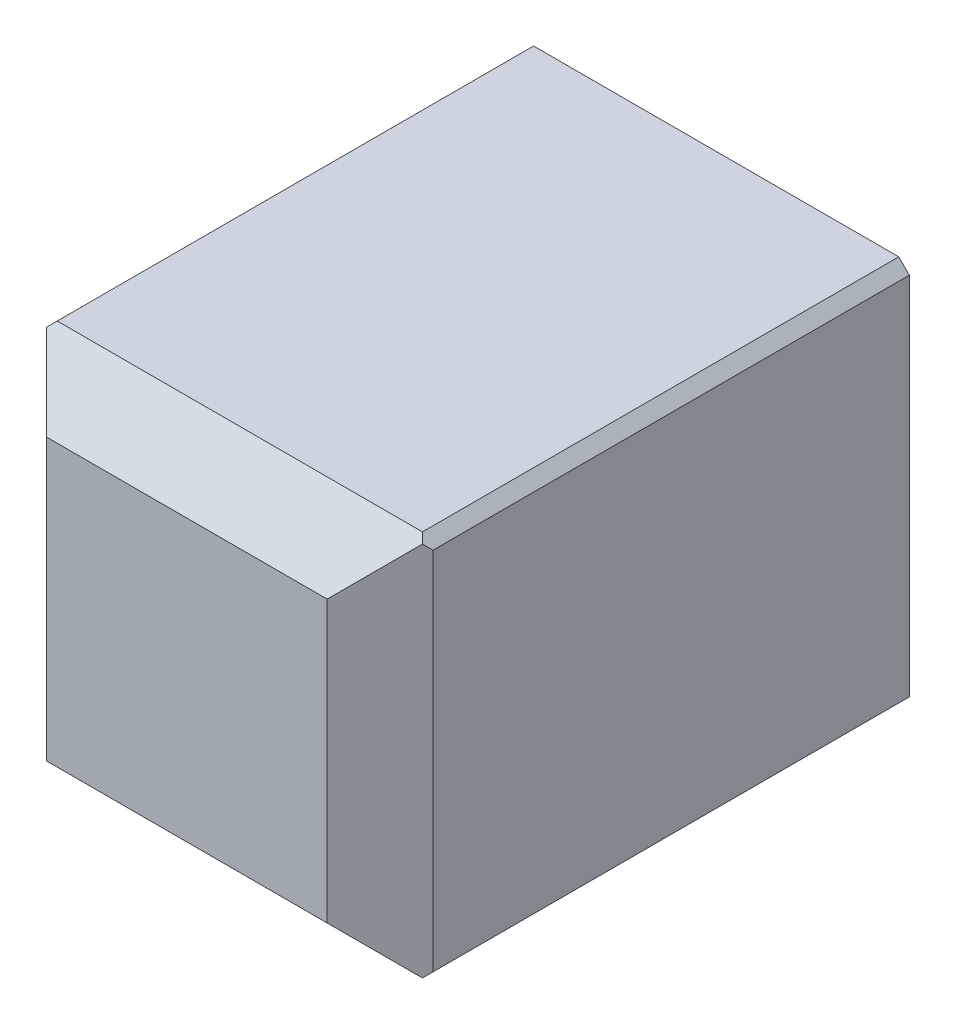
ISO-10303-21;
HEADER;
FILE_DESCRIPTION(('STEP AP214'),'2;1');
FILE_NAME('part.step','',(''),(''),'','','');
FILE_SCHEMA(('AUTOMOTIVE_DESIGN { 1 0 10303 214 1 1 1 1 }'));
ENDSEC;
DATA;
#1=APPLICATION_CONTEXT('core data for automotive mechanical design processes');
#2=APPLICATION_PROTOCOL_DEFINITION('international standard','automotive_design',2000,#1);
#3=PRODUCT_CONTEXT('',#1,'mechanical');
#4=PRODUCT('Part','Part','',(#3));
#5=PRODUCT_RELATED_PRODUCT_CATEGORY('part','',(#4));
#6=PRODUCT_DEFINITION_FORMATION('','',#4);
#7=PRODUCT_DEFINITION_CONTEXT('part definition',#1,'design');
#8=PRODUCT_DEFINITION('design','',#6,#7);
#9=PRODUCT_DEFINITION_SHAPE('','',#8);
#10=(LENGTH_UNIT() NAMED_UNIT(*) SI_UNIT(.MILLI.,.METRE.));
#11=(NAMED_UNIT(*) PLANE_ANGLE_UNIT() SI_UNIT($,.RADIAN.));
#12=(NAMED_UNIT(*) SI_UNIT($,.STERADIAN.) SOLID_ANGLE_UNIT());
#13=UNCERTAINTY_MEASURE_WITH_UNIT(LENGTH_MEASURE(1.E-05),#10,'distance_accuracy_value','');
#14=(GEOMETRIC_REPRESENTATION_CONTEXT(3) GLOBAL_UNCERTAINTY_ASSIGNED_CONTEXT((#13)) GLOBAL_UNIT_ASSIGNED_CONTEXT((#10,
#11,#12)) REPRESENTATION_CONTEXT('',''));
#15=CARTESIAN_POINT('',(0.,0.,0.));
#16=DIRECTION('',(0.,0.,1.));
#17=DIRECTION('',(1.,0.,0.));
#18=AXIS2_PLACEMENT_3D('',#15,#16,#17);
#19=CARTESIAN_POINT('',(0.,0.,0.));
#20=DIRECTION('',(0.,0.,1.));
#21=DIRECTION('',(1.,0.,0.));
#22=AXIS2_PLACEMENT_3D('',#19,#20,#21);
#23=PLANE('',#22);
#24=DIRECTION('',(0.,1.,0.));
#25=VECTOR('',#24,1.);
#26=CARTESIAN_POINT('',(5.3,5.3,0.));
#27=LINE('',#26,#25);
#28=CARTESIAN_POINT('',(5.3,-1.8,0.));
#29=VERTEX_POINT('',#28);
#30=CARTESIAN_POINT('',(5.3,5.1,0.));
#31=VERTEX_POINT('',#30);
#32=EDGE_CURVE('E194',#29,#31,#27,.T.);
#33=ORIENTED_EDGE('',*,*,#32,.F.);
#34=DIRECTION('',(0.707106781186548,0.707106781186548,0.));
#35=VECTOR('',#34,1.);
#36=CARTESIAN_POINT('',(5.3,-1.8,0.));
#37=LINE('',#36,#35);
#38=CARTESIAN_POINT('',(5.1,-2.,0.));
#39=VERTEX_POINT('',#38);
#40=EDGE_CURVE('E262',#29,#39,#37,.F.);
#41=ORIENTED_EDGE('',*,*,#40,.T.);
#42=DIRECTION('',(1.,0.,0.));
#43=VECTOR('',#42,1.);
#44=CARTESIAN_POINT('',(-2.,-2.,0.));
#45=LINE('',#44,#43);
#46=CARTESIAN_POINT('',(-1.8,-2.,0.));
#47=VERTEX_POINT('',#46);
#48=EDGE_CURVE('E190',#47,#39,#45,.T.);
#49=ORIENTED_EDGE('',*,*,#48,.F.);
#50=DIRECTION('',(0.707106781186548,-0.707106781186548,0.));
#51=VECTOR('',#50,1.);
#52=CARTESIAN_POINT('',(-1.8,-2.,0.));
#53=LINE('',#52,#51);
#54=CARTESIAN_POINT('',(-2.,-1.8,0.));
#55=VERTEX_POINT('',#54);
#56=EDGE_CURVE('E253',#47,#55,#53,.F.);
#57=ORIENTED_EDGE('',*,*,#56,.T.);
#58=DIRECTION('',(0.,-1.,0.));
#59=VECTOR('',#58,1.);
#60=CARTESIAN_POINT('',(-2.,5.3,0.));
#61=LINE('',#60,#59);
#62=CARTESIAN_POINT('',(-2.,5.1,0.));
#63=VERTEX_POINT('',#62);
#64=EDGE_CURVE('E182',#63,#55,#61,.T.);
#65=ORIENTED_EDGE('',*,*,#64,.F.);
#66=DIRECTION('',(-0.707106781186548,-0.707106781186548,0.));
#67=VECTOR('',#66,1.);
#68=CARTESIAN_POINT('',(-2.,5.1,0.));
#69=LINE('',#68,#67);
#70=CARTESIAN_POINT('',(-1.8,5.3,0.));
#71=VERTEX_POINT('',#70);
#72=EDGE_CURVE('E256',#63,#71,#69,.F.);
#73=ORIENTED_EDGE('',*,*,#72,.T.);
#74=DIRECTION('',(-1.,0.,0.));
#75=VECTOR('',#74,1.);
#76=CARTESIAN_POINT('',(-2.,5.3,0.));
#77=LINE('',#76,#75);
#78=CARTESIAN_POINT('',(5.1,5.3,0.));
#79=VERTEX_POINT('',#78);
#80=EDGE_CURVE('E198',#79,#71,#77,.T.);
#81=ORIENTED_EDGE('',*,*,#80,.F.);
#82=DIRECTION('',(-0.707106781186548,0.707106781186548,0.));
#83=VECTOR('',#82,1.);
#84=CARTESIAN_POINT('',(5.1,5.3,0.));
#85=LINE('',#84,#83);
#86=EDGE_CURVE('E259',#79,#31,#85,.F.);
#87=ORIENTED_EDGE('',*,*,#86,.T.);
#88=EDGE_LOOP('',(#33,#41,#49,#57,#65,#73,#81,#87));
#89=FACE_BOUND('',#88,.T.);
#90=DIRECTION('',(0.,-1.,0.));
#91=VECTOR('',#90,1.);
#92=CARTESIAN_POINT('',(0.,0.,0.));
#93=LINE('',#92,#91);
#94=CARTESIAN_POINT('',(0.,3.3,0.));
#95=VERTEX_POINT('',#94);
#96=CARTESIAN_POINT('',(0.,0.,0.));
#97=VERTEX_POINT('',#96);
#98=EDGE_CURVE('E246',#95,#97,#93,.T.);
#99=ORIENTED_EDGE('',*,*,#98,.T.);
#100=DIRECTION('',(1.,0.,0.));
#101=VECTOR('',#100,1.);
#102=CARTESIAN_POINT('',(0.,0.,0.));
#103=LINE('',#102,#101);
#104=CARTESIAN_POINT('',(3.3,0.,0.));
#105=VERTEX_POINT('',#104);
#106=EDGE_CURVE('E527',#97,#105,#103,.T.);
#107=ORIENTED_EDGE('',*,*,#106,.T.);
#108=DIRECTION('',(0.,1.,0.));
#109=VECTOR('',#108,1.);
#110=CARTESIAN_POINT('',(3.3,0.,0.));
#111=LINE('',#110,#109);
#112=CARTESIAN_POINT('',(3.3,3.3,0.));
#113=VERTEX_POINT('',#112);
#114=EDGE_CURVE('E175',#105,#113,#111,.T.);
#115=ORIENTED_EDGE('',*,*,#114,.T.);
#116=DIRECTION('',(-1.,0.,0.));
#117=VECTOR('',#116,1.);
#118=CARTESIAN_POINT('',(0.,3.3,0.));
#119=LINE('',#118,#117);
#120=EDGE_CURVE('E530',#113,#95,#119,.T.);
#121=ORIENTED_EDGE('',*,*,#120,.T.);
#122=EDGE_LOOP('',(#99,#107,#115,#121));
#123=FACE_BOUND('',#122,.T.);
#124=ADVANCED_FACE('F38',(#89,#123),#23,.F.);
#125=CARTESIAN_POINT('',(-2.,5.3,8.));
#126=DIRECTION('',(1.,0.,0.));
#127=DIRECTION('',(0.,0.,-1.));
#128=AXIS2_PLACEMENT_3D('',#125,#126,#127);
#129=PLANE('',#128);
#130=DIRECTION('',(0.,1.,0.));
#131=VECTOR('',#130,1.);
#132=CARTESIAN_POINT('',(-2.,5.3,9.));
#133=LINE('',#132,#131);
#134=CARTESIAN_POINT('',(-2.,-1.8,9.));
#135=VERTEX_POINT('',#134);
#136=CARTESIAN_POINT('',(-2.,5.1,9.));
#137=VERTEX_POINT('',#136);
#138=EDGE_CURVE('E228',#135,#137,#133,.T.);
#139=ORIENTED_EDGE('',*,*,#138,.T.);
#140=DIRECTION('',(0.,0.,-1.));
#141=VECTOR('',#140,1.);
#142=CARTESIAN_POINT('',(-2.,5.1,8.));
#143=LINE('',#142,#141);
#144=EDGE_CURVE('E299',#137,#63,#143,.T.);
#145=ORIENTED_EDGE('',*,*,#144,.T.);
#146=ORIENTED_EDGE('',*,*,#64,.T.);
#147=DIRECTION('',(0.,0.,1.));
#148=VECTOR('',#147,1.);
#149=CARTESIAN_POINT('',(-2.,-1.8,8.));
#150=LINE('',#149,#148);
#151=EDGE_CURVE('E59',#55,#135,#150,.T.);
#152=ORIENTED_EDGE('',*,*,#151,.T.);
#153=EDGE_LOOP('',(#139,#145,#146,#152));
#154=FACE_BOUND('',#153,.T.);
#155=ADVANCED_FACE('F365',(#154),#129,.F.);
#156=CARTESIAN_POINT('',(-2.,-2.,8.));
#157=DIRECTION('',(0.,1.,0.));
#158=DIRECTION('',(0.,0.,1.));
#159=AXIS2_PLACEMENT_3D('',#156,#157,#158);
#160=PLANE('',#159);
#161=ORIENTED_EDGE('',*,*,#48,.T.);
#162=DIRECTION('',(0.,0.,1.));
#163=VECTOR('',#162,1.);
#164=CARTESIAN_POINT('',(5.1,-2.,8.));
#165=LINE('',#164,#163);
#166=CARTESIAN_POINT('',(5.1,-2.,9.));
#167=VERTEX_POINT('',#166);
#168=EDGE_CURVE('E269',#39,#167,#165,.T.);
#169=ORIENTED_EDGE('',*,*,#168,.T.);
#170=DIRECTION('',(-1.,0.,0.));
#171=VECTOR('',#170,1.);
#172=CARTESIAN_POINT('',(-2.,-2.,9.));
#173=LINE('',#172,#171);
#174=CARTESIAN_POINT('',(-1.8,-2.,9.));
#175=VERTEX_POINT('',#174);
#176=EDGE_CURVE('E224',#167,#175,#173,.T.);
#177=ORIENTED_EDGE('',*,*,#176,.T.);
#178=DIRECTION('',(0.,0.,-1.));
#179=VECTOR('',#178,1.);
#180=CARTESIAN_POINT('',(-1.8,-2.,8.));
#181=LINE('',#180,#179);
#182=EDGE_CURVE('E265',#175,#47,#181,.T.);
#183=ORIENTED_EDGE('',*,*,#182,.T.);
#184=EDGE_LOOP('',(#161,#169,#177,#183));
#185=FACE_BOUND('',#184,.T.);
#186=ADVANCED_FACE('F317',(#185),#160,.F.);
#187=CARTESIAN_POINT('',(5.3,5.3,8.));
#188=DIRECTION('',(-1.,0.,0.));
#189=DIRECTION('',(0.,0.,1.));
#190=AXIS2_PLACEMENT_3D('',#187,#188,#189);
#191=PLANE('',#190);
#192=DIRECTION('',(0.,-1.,0.));
#193=VECTOR('',#192,1.);
#194=CARTESIAN_POINT('',(5.3,-2.,9.));
#195=LINE('',#194,#193);
#196=CARTESIAN_POINT('',(5.3,5.1,9.));
#197=VERTEX_POINT('',#196);
#198=CARTESIAN_POINT('',(5.3,-1.8,9.));
#199=VERTEX_POINT('',#198);
#200=EDGE_CURVE('E220',#197,#199,#195,.T.);
#201=ORIENTED_EDGE('',*,*,#200,.T.);
#202=DIRECTION('',(0.,0.,-1.));
#203=VECTOR('',#202,1.);
#204=CARTESIAN_POINT('',(5.3,-1.8,8.));
#205=LINE('',#204,#203);
#206=EDGE_CURVE('E249',#199,#29,#205,.T.);
#207=ORIENTED_EDGE('',*,*,#206,.T.);
#208=ORIENTED_EDGE('',*,*,#32,.T.);
#209=DIRECTION('',(0.,0.,1.));
#210=VECTOR('',#209,1.);
#211=CARTESIAN_POINT('',(5.3,5.1,8.));
#212=LINE('',#211,#210);
#213=EDGE_CURVE('E231',#31,#197,#212,.T.);
#214=ORIENTED_EDGE('',*,*,#213,.T.);
#215=EDGE_LOOP('',(#201,#207,#208,#214));
#216=FACE_BOUND('',#215,.T.);
#217=ADVANCED_FACE('F329',(#216),#191,.F.);
#218=CARTESIAN_POINT('',(-2.,5.3,8.));
#219=DIRECTION('',(0.,-1.,0.));
#220=DIRECTION('',(0.,0.,-1.));
#221=AXIS2_PLACEMENT_3D('',#218,#219,#220);
#222=PLANE('',#221);
#223=DIRECTION('',(1.,0.,0.));
#224=VECTOR('',#223,1.);
#225=CARTESIAN_POINT('',(5.3,5.3,9.));
#226=LINE('',#225,#224);
#227=CARTESIAN_POINT('',(-1.8,5.3,9.));
#228=VERTEX_POINT('',#227);
#229=CARTESIAN_POINT('',(5.1,5.3,9.));
#230=VERTEX_POINT('',#229);
#231=EDGE_CURVE('E216',#228,#230,#226,.T.);
#232=ORIENTED_EDGE('',*,*,#231,.T.);
#233=DIRECTION('',(0.,0.,-1.));
#234=VECTOR('',#233,1.);
#235=CARTESIAN_POINT('',(5.1,5.3,8.));
#236=LINE('',#235,#234);
#237=EDGE_CURVE('E287',#230,#79,#236,.T.);
#238=ORIENTED_EDGE('',*,*,#237,.T.);
#239=ORIENTED_EDGE('',*,*,#80,.T.);
#240=DIRECTION('',(0.,0.,1.));
#241=VECTOR('',#240,1.);
#242=CARTESIAN_POINT('',(-1.8,5.3,8.));
#243=LINE('',#242,#241);
#244=EDGE_CURVE('E284',#71,#228,#243,.T.);
#245=ORIENTED_EDGE('',*,*,#244,.T.);
#246=EDGE_LOOP('',(#232,#238,#239,#245));
#247=FACE_BOUND('',#246,.T.);
#248=ADVANCED_FACE('F346',(#247),#222,.F.);
#249=CARTESIAN_POINT('',(0.,0.,8.));
#250=DIRECTION('',(1.,0.,0.));
#251=DIRECTION('',(0.,0.,-1.));
#252=AXIS2_PLACEMENT_3D('',#249,#250,#251);
#253=PLANE('',#252);
#254=ORIENTED_EDGE('',*,*,#98,.F.);
#255=DIRECTION('',(0.,0.,-1.));
#256=VECTOR('',#255,1.);
#257=CARTESIAN_POINT('',(0.,3.3,8.));
#258=LINE('',#257,#256);
#259=CARTESIAN_POINT('',(0.,3.3,8.));
#260=VERTEX_POINT('',#259);
#261=EDGE_CURVE('E184',#260,#95,#258,.T.);
#262=ORIENTED_EDGE('',*,*,#261,.F.);
#263=DIRECTION('',(0.,-1.,0.));
#264=VECTOR('',#263,1.);
#265=CARTESIAN_POINT('',(0.,0.,8.));
#266=LINE('',#265,#264);
#267=CARTESIAN_POINT('',(0.,0.,8.));
#268=VERTEX_POINT('',#267);
#269=EDGE_CURVE('E171',#260,#268,#266,.T.);
#270=ORIENTED_EDGE('',*,*,#269,.T.);
#271=DIRECTION('',(0.,0.,-1.));
#272=VECTOR('',#271,1.);
#273=CARTESIAN_POINT('',(0.,0.,8.));
#274=LINE('',#273,#272);
#275=EDGE_CURVE('E169',#268,#97,#274,.T.);
#276=ORIENTED_EDGE('',*,*,#275,.T.);
#277=EDGE_LOOP('',(#254,#262,#270,#276));
#278=FACE_BOUND('',#277,.T.);
#279=ADVANCED_FACE('F373',(#278),#253,.T.);
#280=CARTESIAN_POINT('',(0.,0.,8.));
#281=DIRECTION('',(0.,1.,0.));
#282=DIRECTION('',(0.,0.,1.));
#283=AXIS2_PLACEMENT_3D('',#280,#281,#282);
#284=PLANE('',#283);
#285=ORIENTED_EDGE('',*,*,#106,.F.);
#286=ORIENTED_EDGE('',*,*,#275,.F.);
#287=DIRECTION('',(1.,0.,0.));
#288=VECTOR('',#287,1.);
#289=CARTESIAN_POINT('',(0.,0.,8.));
#290=LINE('',#289,#288);
#291=CARTESIAN_POINT('',(3.3,0.,8.));
#292=VERTEX_POINT('',#291);
#293=EDGE_CURVE('E154',#268,#292,#290,.T.);
#294=ORIENTED_EDGE('',*,*,#293,.T.);
#295=DIRECTION('',(0.,0.,-1.));
#296=VECTOR('',#295,1.);
#297=CARTESIAN_POINT('',(3.3,0.,8.));
#298=LINE('',#297,#296);
#299=EDGE_CURVE('E166',#292,#105,#298,.T.);
#300=ORIENTED_EDGE('',*,*,#299,.T.);
#301=EDGE_LOOP('',(#285,#286,#294,#300));
#302=FACE_BOUND('',#301,.T.);
#303=ADVANCED_FACE('F165',(#302),#284,.T.);
#304=CARTESIAN_POINT('',(3.3,0.,8.));
#305=DIRECTION('',(-1.,0.,0.));
#306=DIRECTION('',(0.,0.,1.));
#307=AXIS2_PLACEMENT_3D('',#304,#305,#306);
#308=PLANE('',#307);
#309=ORIENTED_EDGE('',*,*,#114,.F.);
#310=ORIENTED_EDGE('',*,*,#299,.F.);
#311=DIRECTION('',(0.,1.,0.));
#312=VECTOR('',#311,1.);
#313=CARTESIAN_POINT('',(3.3,0.,8.));
#314=LINE('',#313,#312);
#315=CARTESIAN_POINT('',(3.3,3.3,8.));
#316=VERTEX_POINT('',#315);
#317=EDGE_CURVE('E151',#292,#316,#314,.T.);
#318=ORIENTED_EDGE('',*,*,#317,.T.);
#319=DIRECTION('',(0.,0.,-1.));
#320=VECTOR('',#319,1.);
#321=CARTESIAN_POINT('',(3.3,3.3,8.));
#322=LINE('',#321,#320);
#323=EDGE_CURVE('E178',#316,#113,#322,.T.);
#324=ORIENTED_EDGE('',*,*,#323,.T.);
#325=EDGE_LOOP('',(#309,#310,#318,#324));
#326=FACE_BOUND('',#325,.T.);
#327=ADVANCED_FACE('F173',(#326),#308,.T.);
#328=CARTESIAN_POINT('',(0.,3.3,8.));
#329=DIRECTION('',(0.,-1.,0.));
#330=DIRECTION('',(0.,0.,-1.));
#331=AXIS2_PLACEMENT_3D('',#328,#329,#330);
#332=PLANE('',#331);
#333=ORIENTED_EDGE('',*,*,#120,.F.);
#334=ORIENTED_EDGE('',*,*,#323,.F.);
#335=DIRECTION('',(-1.,0.,0.));
#336=VECTOR('',#335,1.);
#337=CARTESIAN_POINT('',(0.,3.3,8.));
#338=LINE('',#337,#336);
#339=EDGE_CURVE('E157',#316,#260,#338,.T.);
#340=ORIENTED_EDGE('',*,*,#339,.T.);
#341=ORIENTED_EDGE('',*,*,#261,.T.);
#342=EDGE_LOOP('',(#333,#334,#340,#341));
#343=FACE_BOUND('',#342,.T.);
#344=ADVANCED_FACE('F362',(#343),#332,.T.);
#345=CARTESIAN_POINT('',(0.,0.,8.));
#346=DIRECTION('',(0.,0.,1.));
#347=DIRECTION('',(1.,0.,0.));
#348=AXIS2_PLACEMENT_3D('',#345,#346,#347);
#349=PLANE('',#348);
#350=ORIENTED_EDGE('',*,*,#293,.F.);
#351=ORIENTED_EDGE('',*,*,#269,.F.);
#352=ORIENTED_EDGE('',*,*,#339,.F.);
#353=ORIENTED_EDGE('',*,*,#317,.F.);
#354=EDGE_LOOP('',(#350,#351,#352,#353));
#355=FACE_BOUND('',#354,.T.);
#356=ADVANCED_FACE('F153',(#355),#349,.F.);
#357=CARTESIAN_POINT('',(0.,0.,10.));
#358=DIRECTION('',(0.,0.,1.));
#359=DIRECTION('',(1.,0.,0.));
#360=AXIS2_PLACEMENT_3D('',#357,#358,#359);
#361=PLANE('',#360);
#362=DIRECTION('',(0.,1.,0.));
#363=VECTOR('',#362,1.);
#364=CARTESIAN_POINT('',(4.3,5.3,10.));
#365=LINE('',#364,#363);
#366=CARTESIAN_POINT('',(4.3,-1.,10.));
#367=VERTEX_POINT('',#366);
#368=CARTESIAN_POINT('',(4.3,4.3,10.));
#369=VERTEX_POINT('',#368);
#370=EDGE_CURVE('E209',#367,#369,#365,.T.);
#371=ORIENTED_EDGE('',*,*,#370,.T.);
#372=DIRECTION('',(-1.,0.,0.));
#373=VECTOR('',#372,1.);
#374=CARTESIAN_POINT('',(-2.,4.3,10.));
#375=LINE('',#374,#373);
#376=CARTESIAN_POINT('',(-1.,4.3,10.));
#377=VERTEX_POINT('',#376);
#378=EDGE_CURVE('E212',#369,#377,#375,.T.);
#379=ORIENTED_EDGE('',*,*,#378,.T.);
#380=DIRECTION('',(0.,-1.,0.));
#381=VECTOR('',#380,1.);
#382=CARTESIAN_POINT('',(-1.,-2.,10.));
#383=LINE('',#382,#381);
#384=CARTESIAN_POINT('',(-1.,-1.,10.));
#385=VERTEX_POINT('',#384);
#386=EDGE_CURVE('E202',#377,#385,#383,.T.);
#387=ORIENTED_EDGE('',*,*,#386,.T.);
#388=DIRECTION('',(1.,0.,0.));
#389=VECTOR('',#388,1.);
#390=CARTESIAN_POINT('',(5.3,-1.,10.));
#391=LINE('',#390,#389);
#392=EDGE_CURVE('E206',#385,#367,#391,.T.);
#393=ORIENTED_EDGE('',*,*,#392,.T.);
#394=EDGE_LOOP('',(#371,#379,#387,#393));
#395=FACE_BOUND('',#394,.T.);
#396=ADVANCED_FACE('F353',(#395),#361,.T.);
#397=CARTESIAN_POINT('',(0.,-1.,10.));
#398=DIRECTION('',(0.,-0.707106781186549,0.707106781186546));
#399=DIRECTION('',(-1.,0.,0.));
#400=AXIS2_PLACEMENT_3D('',#397,#398,#399);
#401=PLANE('',#400);
#402=ORIENTED_EDGE('',*,*,#176,.F.);
#403=DIRECTION('',(-0.577350269189625,-0.577350269189625,-0.577350269189627));
#404=VECTOR('',#403,1.);
#405=CARTESIAN_POINT('',(4.06666666666667,-3.03333333333333,7.96666666666667));
#406=LINE('',#405,#404);
#407=CARTESIAN_POINT('',(5.2,-1.9,9.1));
#408=VERTEX_POINT('',#407);
#409=EDGE_CURVE('E275',#167,#408,#406,.F.);
#410=ORIENTED_EDGE('',*,*,#409,.T.);
#411=DIRECTION('',(-0.577350269189625,0.577350269189625,0.577350269189627));
#412=VECTOR('',#411,1.);
#413=CARTESIAN_POINT('',(2.86666666666667,0.433333333333329,11.4333333333333));
#414=LINE('',#413,#412);
#415=EDGE_CURVE('E242',#367,#408,#414,.F.);
#416=ORIENTED_EDGE('',*,*,#415,.F.);
#417=ORIENTED_EDGE('',*,*,#392,.F.);
#418=DIRECTION('',(0.577350269189625,0.577350269189625,0.577350269189627));
#419=VECTOR('',#418,1.);
#420=CARTESIAN_POINT('',(-0.666666666666668,-0.666666666666668,10.3333333333333));
#421=LINE('',#420,#419);
#422=CARTESIAN_POINT('',(-1.9,-1.9,9.1));
#423=VERTEX_POINT('',#422);
#424=EDGE_CURVE('E239',#423,#385,#421,.T.);
#425=ORIENTED_EDGE('',*,*,#424,.F.);
#426=DIRECTION('',(-0.577350269189625,0.577350269189625,0.577350269189627));
#427=VECTOR('',#426,1.);
#428=CARTESIAN_POINT('',(-1.86666666666667,-1.93333333333333,9.06666666666667));
#429=LINE('',#428,#427);
#430=EDGE_CURVE('E272',#423,#175,#429,.F.);
#431=ORIENTED_EDGE('',*,*,#430,.T.);
#432=EDGE_LOOP('',(#402,#410,#416,#417,#425,#431));
#433=FACE_BOUND('',#432,.T.);
#434=ADVANCED_FACE('F312',(#433),#401,.T.);
#435=CARTESIAN_POINT('',(4.3,0.,10.));
#436=DIRECTION('',(0.707106781186549,0.,0.707106781186546));
#437=DIRECTION('',(0.,-1.,0.));
#438=AXIS2_PLACEMENT_3D('',#435,#436,#437);
#439=PLANE('',#438);
#440=ORIENTED_EDGE('',*,*,#415,.T.);
#441=DIRECTION('',(-0.577350269189625,-0.577350269189625,0.577350269189627));
#442=VECTOR('',#441,1.);
#443=CARTESIAN_POINT('',(5.23333333333333,-1.86666666666667,9.06666666666667));
#444=LINE('',#443,#442);
#445=EDGE_CURVE('E281',#408,#199,#444,.F.);
#446=ORIENTED_EDGE('',*,*,#445,.T.);
#447=ORIENTED_EDGE('',*,*,#200,.F.);
#448=DIRECTION('',(0.577350269189625,-0.577350269189625,-0.577350269189627));
#449=VECTOR('',#448,1.);
#450=CARTESIAN_POINT('',(6.33333333333333,4.06666666666667,7.96666666666667));
#451=LINE('',#450,#449);
#452=CARTESIAN_POINT('',(5.2,5.2,9.1));
#453=VERTEX_POINT('',#452);
#454=EDGE_CURVE('E278',#197,#453,#451,.F.);
#455=ORIENTED_EDGE('',*,*,#454,.T.);
#456=DIRECTION('',(-0.577350269189625,-0.577350269189625,0.577350269189627));
#457=VECTOR('',#456,1.);
#458=CARTESIAN_POINT('',(2.86666666666667,2.86666666666667,11.4333333333333));
#459=LINE('',#458,#457);
#460=EDGE_CURVE('E235',#369,#453,#459,.F.);
#461=ORIENTED_EDGE('',*,*,#460,.F.);
#462=ORIENTED_EDGE('',*,*,#370,.F.);
#463=EDGE_LOOP('',(#440,#446,#447,#455,#461,#462));
#464=FACE_BOUND('',#463,.T.);
#465=ADVANCED_FACE('F334',(#464),#439,.T.);
#466=CARTESIAN_POINT('',(-1.,0.,10.));
#467=DIRECTION('',(-0.707106781186549,0.,0.707106781186546));
#468=DIRECTION('',(0.,1.,0.));
#469=AXIS2_PLACEMENT_3D('',#466,#467,#468);
#470=PLANE('',#469);
#471=DIRECTION('',(-0.577350269189625,0.577350269189625,-0.577350269189627));
#472=VECTOR('',#471,1.);
#473=CARTESIAN_POINT('',(0.43333333333333,2.86666666666667,11.4333333333333));
#474=LINE('',#473,#472);
#475=CARTESIAN_POINT('',(-1.9,5.2,9.1));
#476=VERTEX_POINT('',#475);
#477=EDGE_CURVE('E232',#476,#377,#474,.F.);
#478=ORIENTED_EDGE('',*,*,#477,.F.);
#479=DIRECTION('',(0.577350269189625,0.577350269189625,0.577350269189627));
#480=VECTOR('',#479,1.);
#481=CARTESIAN_POINT('',(-3.03333333333333,4.06666666666667,7.96666666666667));
#482=LINE('',#481,#480);
#483=EDGE_CURVE('E11',#476,#137,#482,.F.);
#484=ORIENTED_EDGE('',*,*,#483,.T.);
#485=ORIENTED_EDGE('',*,*,#138,.F.);
#486=DIRECTION('',(-0.577350269189625,0.577350269189625,-0.577350269189627));
#487=VECTOR('',#486,1.);
#488=CARTESIAN_POINT('',(-1.93333333333333,-1.86666666666667,9.06666666666667));
#489=LINE('',#488,#487);
#490=EDGE_CURVE('E47',#135,#423,#489,.F.);
#491=ORIENTED_EDGE('',*,*,#490,.T.);
#492=ORIENTED_EDGE('',*,*,#424,.T.);
#493=ORIENTED_EDGE('',*,*,#386,.F.);
#494=EDGE_LOOP('',(#478,#484,#485,#491,#492,#493));
#495=FACE_BOUND('',#494,.T.);
#496=ADVANCED_FACE('F305',(#495),#470,.T.);
#497=CARTESIAN_POINT('',(0.,4.3,10.));
#498=DIRECTION('',(0.,0.707106781186549,0.707106781186546));
#499=DIRECTION('',(1.,0.,0.));
#500=AXIS2_PLACEMENT_3D('',#497,#498,#499);
#501=PLANE('',#500);
#502=ORIENTED_EDGE('',*,*,#460,.T.);
#503=DIRECTION('',(0.577350269189625,-0.577350269189625,0.577350269189627));
#504=VECTOR('',#503,1.);
#505=CARTESIAN_POINT('',(4.06666666666667,6.33333333333333,7.96666666666667));
#506=LINE('',#505,#504);
#507=EDGE_CURVE('E294',#453,#230,#506,.F.);
#508=ORIENTED_EDGE('',*,*,#507,.T.);
#509=ORIENTED_EDGE('',*,*,#231,.F.);
#510=DIRECTION('',(0.577350269189625,0.577350269189625,-0.577350269189627));
#511=VECTOR('',#510,1.);
#512=CARTESIAN_POINT('',(-1.86666666666667,5.23333333333333,9.06666666666667));
#513=LINE('',#512,#511);
#514=EDGE_CURVE('E291',#228,#476,#513,.F.);
#515=ORIENTED_EDGE('',*,*,#514,.T.);
#516=ORIENTED_EDGE('',*,*,#477,.T.);
#517=ORIENTED_EDGE('',*,*,#378,.F.);
#518=EDGE_LOOP('',(#502,#508,#509,#515,#516,#517));
#519=FACE_BOUND('',#518,.T.);
#520=ADVANCED_FACE('F342',(#519),#501,.T.);
#521=CARTESIAN_POINT('',(5.3,-1.8,8.));
#522=DIRECTION('',(-0.707106781186547,0.707106781186547,0.));
#523=DIRECTION('',(0.,0.,-1.));
#524=AXIS2_PLACEMENT_3D('',#521,#522,#523);
#525=PLANE('',#524);
#526=ORIENTED_EDGE('',*,*,#409,.F.);
#527=ORIENTED_EDGE('',*,*,#168,.F.);
#528=ORIENTED_EDGE('',*,*,#40,.F.);
#529=ORIENTED_EDGE('',*,*,#206,.F.);
#530=ORIENTED_EDGE('',*,*,#445,.F.);
#531=EDGE_LOOP('',(#526,#527,#528,#529,#530));
#532=FACE_BOUND('',#531,.T.);
#533=ADVANCED_FACE('F326',(#532),#525,.F.);
#534=CARTESIAN_POINT('',(5.1,5.3,8.));
#535=DIRECTION('',(-0.707106781186547,-0.707106781186547,0.));
#536=DIRECTION('',(0.,0.,-1.));
#537=AXIS2_PLACEMENT_3D('',#534,#535,#536);
#538=PLANE('',#537);
#539=ORIENTED_EDGE('',*,*,#454,.F.);
#540=ORIENTED_EDGE('',*,*,#213,.F.);
#541=ORIENTED_EDGE('',*,*,#86,.F.);
#542=ORIENTED_EDGE('',*,*,#237,.F.);
#543=ORIENTED_EDGE('',*,*,#507,.F.);
#544=EDGE_LOOP('',(#539,#540,#541,#542,#543));
#545=FACE_BOUND('',#544,.T.);
#546=ADVANCED_FACE('F338',(#545),#538,.F.);
#547=CARTESIAN_POINT('',(-2.,5.1,8.));
#548=DIRECTION('',(0.707106781186547,-0.707106781186547,0.));
#549=DIRECTION('',(0.,0.,-1.));
#550=AXIS2_PLACEMENT_3D('',#547,#548,#549);
#551=PLANE('',#550);
#552=ORIENTED_EDGE('',*,*,#514,.F.);
#553=ORIENTED_EDGE('',*,*,#244,.F.);
#554=ORIENTED_EDGE('',*,*,#72,.F.);
#555=ORIENTED_EDGE('',*,*,#144,.F.);
#556=ORIENTED_EDGE('',*,*,#483,.F.);
#557=EDGE_LOOP('',(#552,#553,#554,#555,#556));
#558=FACE_BOUND('',#557,.T.);
#559=ADVANCED_FACE('F350',(#558),#551,.F.);
#560=CARTESIAN_POINT('',(-1.8,-2.,8.));
#561=DIRECTION('',(0.707106781186547,0.707106781186547,0.));
#562=DIRECTION('',(0.,0.,-1.));
#563=AXIS2_PLACEMENT_3D('',#560,#561,#562);
#564=PLANE('',#563);
#565=ORIENTED_EDGE('',*,*,#490,.F.);
#566=ORIENTED_EDGE('',*,*,#151,.F.);
#567=ORIENTED_EDGE('',*,*,#56,.F.);
#568=ORIENTED_EDGE('',*,*,#182,.F.);
#569=ORIENTED_EDGE('',*,*,#430,.F.);
#570=EDGE_LOOP('',(#565,#566,#567,#568,#569));
#571=FACE_BOUND('',#570,.T.);
#572=ADVANCED_FACE('F40',(#571),#564,.F.);
#573=CLOSED_SHELL('',(#124,#155,#186,#217,#248,#279,#303,#327,#344,#356,#396,#434,#465,#496,
#520,#533,#546,#559,#572));
#574=MANIFOLD_SOLID_BREP('B2',#573);
#575=ADVANCED_BREP_SHAPE_REPRESENTATION('',(#18,#574),#14);
#576=SHAPE_DEFINITION_REPRESENTATION(#9,#575);
ENDSEC;
END-ISO-10303-21;
